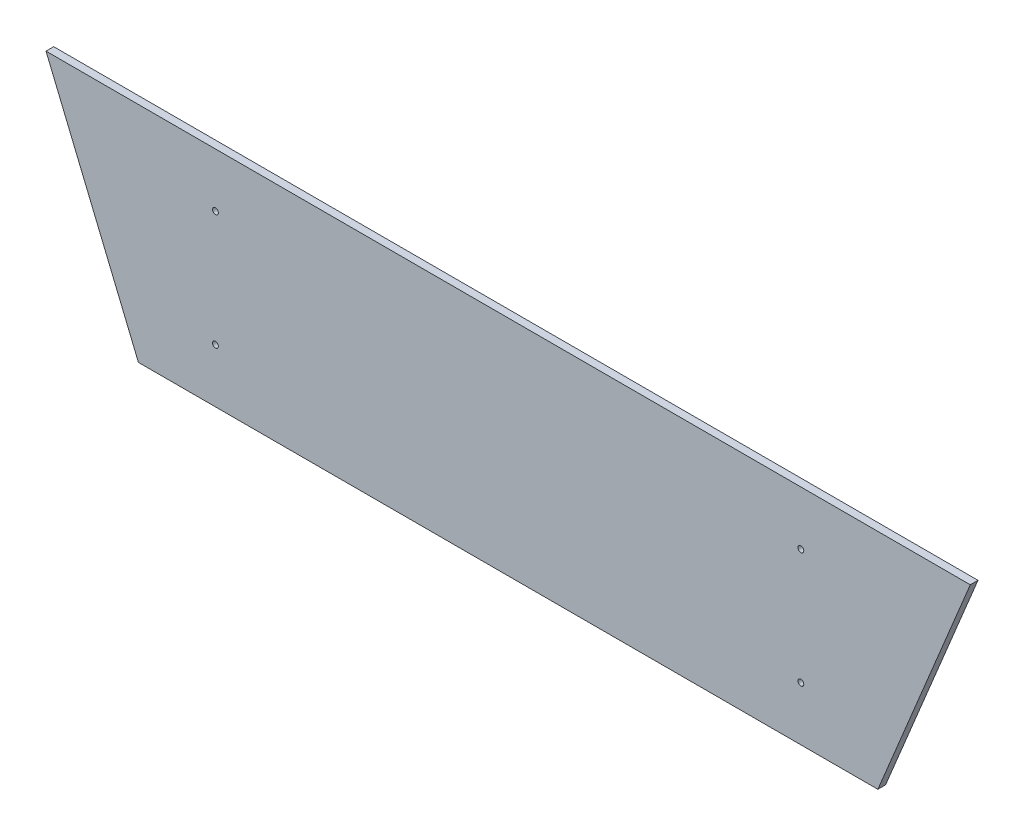
ISO-10303-21;
HEADER;
FILE_DESCRIPTION(('STEP AP214'),'2;1');
FILE_NAME('part.step','',(''),(''),'','','');
FILE_SCHEMA(('AUTOMOTIVE_DESIGN { 1 0 10303 214 1 1 1 1 }'));
ENDSEC;
DATA;
#1=APPLICATION_CONTEXT('core data for automotive mechanical design processes');
#2=APPLICATION_PROTOCOL_DEFINITION('international standard','automotive_design',2000,#1);
#3=PRODUCT_CONTEXT('',#1,'mechanical');
#4=PRODUCT('Part','Part','',(#3));
#5=PRODUCT_RELATED_PRODUCT_CATEGORY('part','',(#4));
#6=PRODUCT_DEFINITION_FORMATION('','',#4);
#7=PRODUCT_DEFINITION_CONTEXT('part definition',#1,'design');
#8=PRODUCT_DEFINITION('design','',#6,#7);
#9=PRODUCT_DEFINITION_SHAPE('','',#8);
#10=(LENGTH_UNIT() NAMED_UNIT(*) SI_UNIT(.MILLI.,.METRE.));
#11=(NAMED_UNIT(*) PLANE_ANGLE_UNIT() SI_UNIT($,.RADIAN.));
#12=(NAMED_UNIT(*) SI_UNIT($,.STERADIAN.) SOLID_ANGLE_UNIT());
#13=UNCERTAINTY_MEASURE_WITH_UNIT(LENGTH_MEASURE(1.E-05),#10,'distance_accuracy_value','');
#14=(GEOMETRIC_REPRESENTATION_CONTEXT(3) GLOBAL_UNCERTAINTY_ASSIGNED_CONTEXT((#13)) GLOBAL_UNIT_ASSIGNED_CONTEXT((#10,
#11,#12)) REPRESENTATION_CONTEXT('',''));
#15=CARTESIAN_POINT('',(0.,0.,0.));
#16=DIRECTION('',(0.,0.,1.));
#17=DIRECTION('',(1.,0.,0.));
#18=AXIS2_PLACEMENT_3D('',#15,#16,#17);
#19=CARTESIAN_POINT('',(0.,0.,0.));
#20=DIRECTION('',(0.,0.,1.));
#21=DIRECTION('',(1.,0.,0.));
#22=AXIS2_PLACEMENT_3D('',#19,#20,#21);
#23=PLANE('',#22);
#24=CARTESIAN_POINT('',(241.3,44.45,0.));
#25=DIRECTION('',(0.,0.,1.));
#26=DIRECTION('',(1.,0.,0.));
#27=AXIS2_PLACEMENT_3D('',#24,#25,#26);
#28=CIRCLE('',#27,2.413);
#29=CARTESIAN_POINT('',(243.713,44.45,0.));
#30=VERTEX_POINT('',#29);
#31=EDGE_CURVE('E90',#30,#30,#28,.T.);
#32=ORIENTED_EDGE('',*,*,#31,.T.);
#33=EDGE_LOOP('',(#32));
#34=FACE_BOUND('',#33,.T.);
#35=CARTESIAN_POINT('',(241.3,139.7,0.));
#36=DIRECTION('',(0.,0.,1.));
#37=DIRECTION('',(1.,0.,0.));
#38=AXIS2_PLACEMENT_3D('',#35,#36,#37);
#39=CIRCLE('',#38,2.413);
#40=CARTESIAN_POINT('',(243.713,139.7,0.));
#41=VERTEX_POINT('',#40);
#42=EDGE_CURVE('E94',#41,#41,#39,.T.);
#43=ORIENTED_EDGE('',*,*,#42,.T.);
#44=EDGE_LOOP('',(#43));
#45=FACE_BOUND('',#44,.T.);
#46=CARTESIAN_POINT('',(-241.3,139.7,0.));
#47=DIRECTION('',(0.,0.,1.));
#48=DIRECTION('',(1.,0.,0.));
#49=AXIS2_PLACEMENT_3D('',#46,#47,#48);
#50=CIRCLE('',#49,2.413);
#51=CARTESIAN_POINT('',(-238.887,139.7,0.));
#52=VERTEX_POINT('',#51);
#53=EDGE_CURVE('E96',#52,#52,#50,.T.);
#54=ORIENTED_EDGE('',*,*,#53,.T.);
#55=EDGE_LOOP('',(#54));
#56=FACE_BOUND('',#55,.T.);
#57=CARTESIAN_POINT('',(-241.3,44.45,0.));
#58=DIRECTION('',(0.,0.,1.));
#59=DIRECTION('',(1.,0.,0.));
#60=AXIS2_PLACEMENT_3D('',#57,#58,#59);
#61=CIRCLE('',#60,2.413);
#62=CARTESIAN_POINT('',(-238.887,44.45,0.));
#63=VERTEX_POINT('',#62);
#64=EDGE_CURVE('E20',#63,#63,#61,.T.);
#65=ORIENTED_EDGE('',*,*,#64,.T.);
#66=EDGE_LOOP('',(#65));
#67=FACE_BOUND('',#66,.T.);
#68=DIRECTION('',(1.,0.,0.));
#69=VECTOR('',#68,1.);
#70=CARTESIAN_POINT('',(381.,184.15,0.));
#71=LINE('',#70,#69);
#72=CARTESIAN_POINT('',(381.,184.15,0.));
#73=VERTEX_POINT('',#72);
#74=CARTESIAN_POINT('',(-381.,184.15,0.));
#75=VERTEX_POINT('',#74);
#76=EDGE_CURVE('E55',#73,#75,#71,.F.);
#77=ORIENTED_EDGE('',*,*,#76,.F.);
#78=DIRECTION('',(0.382351792726297,0.924016832421892,0.));
#79=VECTOR('',#78,1.);
#80=CARTESIAN_POINT('',(304.8,0.,0.));
#81=LINE('',#80,#79);
#82=CARTESIAN_POINT('',(304.8,0.,0.));
#83=VERTEX_POINT('',#82);
#84=EDGE_CURVE('E60',#83,#73,#81,.T.);
#85=ORIENTED_EDGE('',*,*,#84,.F.);
#86=DIRECTION('',(1.,0.,0.));
#87=VECTOR('',#86,1.);
#88=CARTESIAN_POINT('',(-304.8,0.,0.));
#89=LINE('',#88,#87);
#90=CARTESIAN_POINT('',(-304.8,-1.31838984174237E-13,0.));
#91=VERTEX_POINT('',#90);
#92=EDGE_CURVE('E101',#91,#83,#89,.T.);
#93=ORIENTED_EDGE('',*,*,#92,.F.);
#94=DIRECTION('',(0.382351792726297,-0.924016832421892,0.));
#95=VECTOR('',#94,1.);
#96=CARTESIAN_POINT('',(-381.,184.15,0.));
#97=LINE('',#96,#95);
#98=EDGE_CURVE('E70',#75,#91,#97,.T.);
#99=ORIENTED_EDGE('',*,*,#98,.F.);
#100=EDGE_LOOP('',(#77,#85,#93,#99));
#101=FACE_BOUND('',#100,.T.);
#102=ADVANCED_FACE('F17',(#34,#45,#56,#67,#101),#23,.F.);
#103=CARTESIAN_POINT('',(304.8,0.,0.));
#104=DIRECTION('',(0.924016832421892,-0.382351792726297,0.));
#105=DIRECTION('',(0.382351792726297,0.924016832421892,0.));
#106=AXIS2_PLACEMENT_3D('',#103,#104,#105);
#107=PLANE('',#106);
#108=DIRECTION('',(0.,0.,-1.));
#109=VECTOR('',#108,1.);
#110=CARTESIAN_POINT('',(304.8,0.,0.));
#111=LINE('',#110,#109);
#112=CARTESIAN_POINT('',(304.8,0.,6.35));
#113=VERTEX_POINT('',#112);
#114=EDGE_CURVE('E65',#83,#113,#111,.F.);
#115=ORIENTED_EDGE('',*,*,#114,.F.);
#116=ORIENTED_EDGE('',*,*,#84,.T.);
#117=DIRECTION('',(0.,0.,1.));
#118=VECTOR('',#117,1.);
#119=CARTESIAN_POINT('',(381.,184.15,0.));
#120=LINE('',#119,#118);
#121=CARTESIAN_POINT('',(381.,184.15,6.35));
#122=VERTEX_POINT('',#121);
#123=EDGE_CURVE('E62',#122,#73,#120,.F.);
#124=ORIENTED_EDGE('',*,*,#123,.F.);
#125=DIRECTION('',(0.3823517927263,0.924016832421891,0.));
#126=VECTOR('',#125,1.);
#127=CARTESIAN_POINT('',(304.8,0.,6.35));
#128=LINE('',#127,#126);
#129=EDGE_CURVE('E93',#113,#122,#128,.T.);
#130=ORIENTED_EDGE('',*,*,#129,.F.);
#131=EDGE_LOOP('',(#115,#116,#124,#130));
#132=FACE_BOUND('',#131,.T.);
#133=ADVANCED_FACE('F61',(#132),#107,.T.);
#134=CARTESIAN_POINT('',(381.,184.15,0.));
#135=DIRECTION('',(0.,1.,0.));
#136=DIRECTION('',(0.,0.,1.));
#137=AXIS2_PLACEMENT_3D('',#134,#135,#136);
#138=PLANE('',#137);
#139=ORIENTED_EDGE('',*,*,#123,.T.);
#140=ORIENTED_EDGE('',*,*,#76,.T.);
#141=DIRECTION('',(0.,0.,1.));
#142=VECTOR('',#141,1.);
#143=CARTESIAN_POINT('',(-381.,184.15,0.));
#144=LINE('',#143,#142);
#145=CARTESIAN_POINT('',(-381.,184.15,6.35));
#146=VERTEX_POINT('',#145);
#147=EDGE_CURVE('E72',#146,#75,#144,.F.);
#148=ORIENTED_EDGE('',*,*,#147,.F.);
#149=DIRECTION('',(1.,0.,0.));
#150=VECTOR('',#149,1.);
#151=CARTESIAN_POINT('',(0.,184.15,6.35));
#152=LINE('',#151,#150);
#153=EDGE_CURVE('E76',#122,#146,#152,.F.);
#154=ORIENTED_EDGE('',*,*,#153,.F.);
#155=EDGE_LOOP('',(#139,#140,#148,#154));
#156=FACE_BOUND('',#155,.T.);
#157=ADVANCED_FACE('F74',(#156),#138,.T.);
#158=CARTESIAN_POINT('',(-381.,184.15,0.));
#159=DIRECTION('',(-0.924016832421892,-0.382351792726297,0.));
#160=DIRECTION('',(0.382351792726297,-0.924016832421892,0.));
#161=AXIS2_PLACEMENT_3D('',#158,#159,#160);
#162=PLANE('',#161);
#163=ORIENTED_EDGE('',*,*,#147,.T.);
#164=ORIENTED_EDGE('',*,*,#98,.T.);
#165=DIRECTION('',(0.,0.,-1.));
#166=VECTOR('',#165,1.);
#167=CARTESIAN_POINT('',(-304.8,0.,0.));
#168=LINE('',#167,#166);
#169=CARTESIAN_POINT('',(-304.8,-1.45716771982052E-13,6.35));
#170=VERTEX_POINT('',#169);
#171=EDGE_CURVE('E35',#170,#91,#168,.T.);
#172=ORIENTED_EDGE('',*,*,#171,.F.);
#173=DIRECTION('',(0.3823517927263,-0.924016832421891,0.));
#174=VECTOR('',#173,1.);
#175=CARTESIAN_POINT('',(-381.,184.15,6.35));
#176=LINE('',#175,#174);
#177=EDGE_CURVE('E113',#146,#170,#176,.T.);
#178=ORIENTED_EDGE('',*,*,#177,.F.);
#179=EDGE_LOOP('',(#163,#164,#172,#178));
#180=FACE_BOUND('',#179,.T.);
#181=ADVANCED_FACE('F111',(#180),#162,.T.);
#182=CARTESIAN_POINT('',(-304.8,0.,0.));
#183=DIRECTION('',(0.,-1.,0.));
#184=DIRECTION('',(0.,0.,-1.));
#185=AXIS2_PLACEMENT_3D('',#182,#183,#184);
#186=PLANE('',#185);
#187=ORIENTED_EDGE('',*,*,#171,.T.);
#188=ORIENTED_EDGE('',*,*,#92,.T.);
#189=ORIENTED_EDGE('',*,*,#114,.T.);
#190=DIRECTION('',(1.,0.,0.));
#191=VECTOR('',#190,1.);
#192=CARTESIAN_POINT('',(0.,0.,6.35));
#193=LINE('',#192,#191);
#194=EDGE_CURVE('E89',#170,#113,#193,.T.);
#195=ORIENTED_EDGE('',*,*,#194,.F.);
#196=EDGE_LOOP('',(#187,#188,#189,#195));
#197=FACE_BOUND('',#196,.T.);
#198=ADVANCED_FACE('F119',(#197),#186,.T.);
#199=CARTESIAN_POINT('',(-241.3,44.45,6.35));
#200=DIRECTION('',(0.,0.,1.));
#201=DIRECTION('',(1.,0.,0.));
#202=AXIS2_PLACEMENT_3D('',#199,#200,#201);
#203=CYLINDRICAL_SURFACE('',#202,2.413);
#204=CARTESIAN_POINT('',(-241.3,44.45,6.35));
#205=DIRECTION('',(0.,0.,1.));
#206=DIRECTION('',(1.,0.,0.));
#207=AXIS2_PLACEMENT_3D('',#204,#205,#206);
#208=CIRCLE('',#207,2.413);
#209=CARTESIAN_POINT('',(-238.887,44.45,6.35));
#210=VERTEX_POINT('',#209);
#211=EDGE_CURVE('E86',#210,#210,#208,.F.);
#212=ORIENTED_EDGE('',*,*,#211,.F.);
#213=EDGE_LOOP('',(#212));
#214=FACE_BOUND('',#213,.T.);
#215=ORIENTED_EDGE('',*,*,#64,.F.);
#216=EDGE_LOOP('',(#215));
#217=FACE_BOUND('',#216,.T.);
#218=ADVANCED_FACE('F121',(#214,#217),#203,.F.);
#219=CARTESIAN_POINT('',(-241.3,139.7,6.35));
#220=DIRECTION('',(0.,0.,1.));
#221=DIRECTION('',(1.,0.,0.));
#222=AXIS2_PLACEMENT_3D('',#219,#220,#221);
#223=CYLINDRICAL_SURFACE('',#222,2.413);
#224=CARTESIAN_POINT('',(-241.3,139.7,6.35));
#225=DIRECTION('',(0.,0.,1.));
#226=DIRECTION('',(1.,0.,0.));
#227=AXIS2_PLACEMENT_3D('',#224,#225,#226);
#228=CIRCLE('',#227,2.413);
#229=CARTESIAN_POINT('',(-238.887,139.7,6.35));
#230=VERTEX_POINT('',#229);
#231=EDGE_CURVE('E83',#230,#230,#228,.F.);
#232=ORIENTED_EDGE('',*,*,#231,.F.);
#233=EDGE_LOOP('',(#232));
#234=FACE_BOUND('',#233,.T.);
#235=ORIENTED_EDGE('',*,*,#53,.F.);
#236=EDGE_LOOP('',(#235));
#237=FACE_BOUND('',#236,.T.);
#238=ADVANCED_FACE('F128',(#234,#237),#223,.F.);
#239=CARTESIAN_POINT('',(241.3,139.7,6.35));
#240=DIRECTION('',(0.,0.,1.));
#241=DIRECTION('',(1.,0.,0.));
#242=AXIS2_PLACEMENT_3D('',#239,#240,#241);
#243=CYLINDRICAL_SURFACE('',#242,2.413);
#244=CARTESIAN_POINT('',(241.3,139.7,6.35));
#245=DIRECTION('',(0.,0.,1.));
#246=DIRECTION('',(1.,0.,0.));
#247=AXIS2_PLACEMENT_3D('',#244,#245,#246);
#248=CIRCLE('',#247,2.413);
#249=CARTESIAN_POINT('',(243.713,139.7,6.35));
#250=VERTEX_POINT('',#249);
#251=EDGE_CURVE('E26',#250,#250,#248,.F.);
#252=ORIENTED_EDGE('',*,*,#251,.F.);
#253=EDGE_LOOP('',(#252));
#254=FACE_BOUND('',#253,.T.);
#255=ORIENTED_EDGE('',*,*,#42,.F.);
#256=EDGE_LOOP('',(#255));
#257=FACE_BOUND('',#256,.T.);
#258=ADVANCED_FACE('F139',(#254,#257),#243,.F.);
#259=CARTESIAN_POINT('',(241.3,44.45,6.35));
#260=DIRECTION('',(0.,0.,1.));
#261=DIRECTION('',(1.,0.,0.));
#262=AXIS2_PLACEMENT_3D('',#259,#260,#261);
#263=CYLINDRICAL_SURFACE('',#262,2.413);
#264=CARTESIAN_POINT('',(241.3,44.45,6.35));
#265=DIRECTION('',(0.,0.,1.));
#266=DIRECTION('',(1.,0.,0.));
#267=AXIS2_PLACEMENT_3D('',#264,#265,#266);
#268=CIRCLE('',#267,2.413);
#269=CARTESIAN_POINT('',(243.713,44.45,6.35));
#270=VERTEX_POINT('',#269);
#271=EDGE_CURVE('E11',#270,#270,#268,.F.);
#272=ORIENTED_EDGE('',*,*,#271,.F.);
#273=EDGE_LOOP('',(#272));
#274=FACE_BOUND('',#273,.T.);
#275=ORIENTED_EDGE('',*,*,#31,.F.);
#276=EDGE_LOOP('',(#275));
#277=FACE_BOUND('',#276,.T.);
#278=ADVANCED_FACE('F133',(#274,#277),#263,.F.);
#279=CARTESIAN_POINT('',(0.,0.,6.35));
#280=DIRECTION('',(0.,0.,1.));
#281=DIRECTION('',(1.,0.,0.));
#282=AXIS2_PLACEMENT_3D('',#279,#280,#281);
#283=PLANE('',#282);
#284=ORIENTED_EDGE('',*,*,#271,.T.);
#285=EDGE_LOOP('',(#284));
#286=FACE_BOUND('',#285,.T.);
#287=ORIENTED_EDGE('',*,*,#251,.T.);
#288=EDGE_LOOP('',(#287));
#289=FACE_BOUND('',#288,.T.);
#290=ORIENTED_EDGE('',*,*,#231,.T.);
#291=EDGE_LOOP('',(#290));
#292=FACE_BOUND('',#291,.T.);
#293=ORIENTED_EDGE('',*,*,#211,.T.);
#294=EDGE_LOOP('',(#293));
#295=FACE_BOUND('',#294,.T.);
#296=ORIENTED_EDGE('',*,*,#177,.T.);
#297=ORIENTED_EDGE('',*,*,#194,.T.);
#298=ORIENTED_EDGE('',*,*,#129,.T.);
#299=ORIENTED_EDGE('',*,*,#153,.T.);
#300=EDGE_LOOP('',(#296,#297,#298,#299));
#301=FACE_BOUND('',#300,.T.);
#302=ADVANCED_FACE('F117',(#286,#289,#292,#295,#301),#283,.T.);
#303=CLOSED_SHELL('',(#102,#133,#157,#181,#198,#218,#238,#258,#278,#302));
#304=MANIFOLD_SOLID_BREP('B1',#303);
#305=ADVANCED_BREP_SHAPE_REPRESENTATION('',(#18,#304),#14);
#306=SHAPE_DEFINITION_REPRESENTATION(#9,#305);
ENDSEC;
END-ISO-10303-21;
